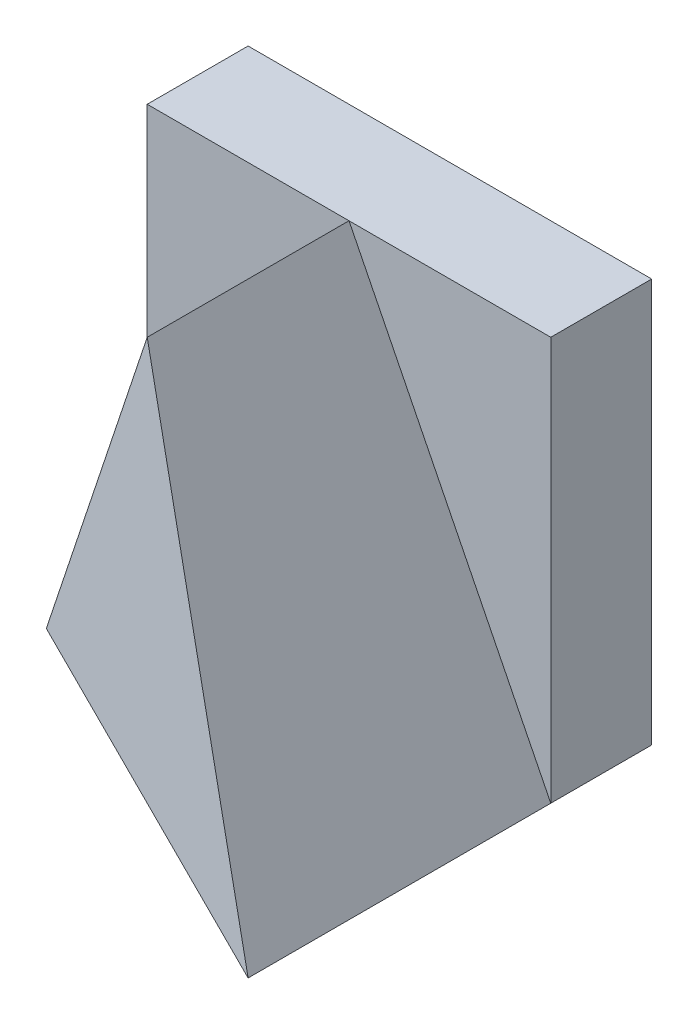
ISO-10303-21;
HEADER;
FILE_DESCRIPTION(('STEP AP214'),'2;1');
FILE_NAME('part.step','',(''),(''),'','','');
FILE_SCHEMA(('AUTOMOTIVE_DESIGN { 1 0 10303 214 1 1 1 1 }'));
ENDSEC;
DATA;
#1=APPLICATION_CONTEXT('core data for automotive mechanical design processes');
#2=APPLICATION_PROTOCOL_DEFINITION('international standard','automotive_design',2000,#1);
#3=PRODUCT_CONTEXT('',#1,'mechanical');
#4=PRODUCT('Part','Part','',(#3));
#5=PRODUCT_RELATED_PRODUCT_CATEGORY('part','',(#4));
#6=PRODUCT_DEFINITION_FORMATION('','',#4);
#7=PRODUCT_DEFINITION_CONTEXT('part definition',#1,'design');
#8=PRODUCT_DEFINITION('design','',#6,#7);
#9=PRODUCT_DEFINITION_SHAPE('','',#8);
#10=(LENGTH_UNIT() NAMED_UNIT(*) SI_UNIT(.MILLI.,.METRE.));
#11=(NAMED_UNIT(*) PLANE_ANGLE_UNIT() SI_UNIT($,.RADIAN.));
#12=(NAMED_UNIT(*) SI_UNIT($,.STERADIAN.) SOLID_ANGLE_UNIT());
#13=UNCERTAINTY_MEASURE_WITH_UNIT(LENGTH_MEASURE(1.E-05),#10,'distance_accuracy_value','');
#14=(GEOMETRIC_REPRESENTATION_CONTEXT(3) GLOBAL_UNCERTAINTY_ASSIGNED_CONTEXT((#13)) GLOBAL_UNIT_ASSIGNED_CONTEXT((#10,
#11,#12)) REPRESENTATION_CONTEXT('',''));
#15=CARTESIAN_POINT('',(0.,0.,0.));
#16=DIRECTION('',(0.,0.,1.));
#17=DIRECTION('',(1.,0.,0.));
#18=AXIS2_PLACEMENT_3D('',#15,#16,#17);
#19=CARTESIAN_POINT('',(0.,4.,0.));
#20=DIRECTION('',(0.,-1.,0.));
#21=DIRECTION('',(0.,0.,-1.));
#22=AXIS2_PLACEMENT_3D('',#19,#20,#21);
#23=PLANE('',#22);
#24=DIRECTION('',(-1.,0.,0.));
#25=VECTOR('',#24,1.);
#26=CARTESIAN_POINT('',(0.,4.,-1.));
#27=LINE('',#26,#25);
#28=CARTESIAN_POINT('',(0.,4.,-1.));
#29=VERTEX_POINT('',#28);
#30=CARTESIAN_POINT('',(-2.,4.,-1.));
#31=VERTEX_POINT('',#30);
#32=EDGE_CURVE('E136',#29,#31,#27,.T.);
#33=ORIENTED_EDGE('',*,*,#32,.F.);
#34=DIRECTION('',(-1.,0.,0.));
#35=VECTOR('',#34,1.);
#36=CARTESIAN_POINT('',(0.,4.,-1.));
#37=LINE('',#36,#35);
#38=CARTESIAN_POINT('',(2.,4.,-1.));
#39=VERTEX_POINT('',#38);
#40=EDGE_CURVE('E123',#39,#29,#37,.T.);
#41=ORIENTED_EDGE('',*,*,#40,.F.);
#42=DIRECTION('',(0.,0.,-1.));
#43=VECTOR('',#42,1.);
#44=CARTESIAN_POINT('',(2.,4.,2.));
#45=LINE('',#44,#43);
#46=CARTESIAN_POINT('',(2.,4.,-2.));
#47=VERTEX_POINT('',#46);
#48=EDGE_CURVE('E111',#39,#47,#45,.T.);
#49=ORIENTED_EDGE('',*,*,#48,.T.);
#50=DIRECTION('',(-1.,0.,0.));
#51=VECTOR('',#50,1.);
#52=CARTESIAN_POINT('',(-2.,4.,-2.));
#53=LINE('',#52,#51);
#54=CARTESIAN_POINT('',(-2.,4.,-2.));
#55=VERTEX_POINT('',#54);
#56=EDGE_CURVE('E74',#47,#55,#53,.T.);
#57=ORIENTED_EDGE('',*,*,#56,.T.);
#58=DIRECTION('',(0.,0.,1.));
#59=VECTOR('',#58,1.);
#60=CARTESIAN_POINT('',(-2.,4.,2.));
#61=LINE('',#60,#59);
#62=EDGE_CURVE('E104',#55,#31,#61,.T.);
#63=ORIENTED_EDGE('',*,*,#62,.T.);
#64=EDGE_LOOP('',(#33,#41,#49,#57,#63));
#65=FACE_BOUND('',#64,.T.);
#66=ADVANCED_FACE('F51',(#65),#23,.F.);
#67=CARTESIAN_POINT('',(-2.,4.,2.));
#68=DIRECTION('',(1.,0.,0.));
#69=DIRECTION('',(0.,0.,-1.));
#70=AXIS2_PLACEMENT_3D('',#67,#68,#69);
#71=PLANE('',#70);
#72=DIRECTION('',(0.,-1.,0.));
#73=VECTOR('',#72,1.);
#74=CARTESIAN_POINT('',(-2.,0.,-1.));
#75=LINE('',#74,#73);
#76=CARTESIAN_POINT('',(-2.,0.,-1.));
#77=VERTEX_POINT('',#76);
#78=EDGE_CURVE('E133',#31,#77,#75,.T.);
#79=ORIENTED_EDGE('',*,*,#78,.F.);
#80=ORIENTED_EDGE('',*,*,#62,.F.);
#81=DIRECTION('',(0.,-1.,0.));
#82=VECTOR('',#81,1.);
#83=CARTESIAN_POINT('',(-2.,4.,-2.));
#84=LINE('',#83,#82);
#85=CARTESIAN_POINT('',(-2.,0.,-2.));
#86=VERTEX_POINT('',#85);
#87=EDGE_CURVE('E90',#55,#86,#84,.T.);
#88=ORIENTED_EDGE('',*,*,#87,.T.);
#89=DIRECTION('',(0.,0.,1.));
#90=VECTOR('',#89,1.);
#91=CARTESIAN_POINT('',(-2.,0.,2.));
#92=LINE('',#91,#90);
#93=EDGE_CURVE('E96',#86,#77,#92,.T.);
#94=ORIENTED_EDGE('',*,*,#93,.T.);
#95=EDGE_LOOP('',(#79,#80,#88,#94));
#96=FACE_BOUND('',#95,.T.);
#97=ADVANCED_FACE('F102',(#96),#71,.F.);
#98=CARTESIAN_POINT('',(2.,4.,2.));
#99=DIRECTION('',(-1.,0.,0.));
#100=DIRECTION('',(0.,0.,1.));
#101=AXIS2_PLACEMENT_3D('',#98,#99,#100);
#102=PLANE('',#101);
#103=DIRECTION('',(0.,1.,0.));
#104=VECTOR('',#103,1.);
#105=CARTESIAN_POINT('',(2.,0.,-1.));
#106=LINE('',#105,#104);
#107=CARTESIAN_POINT('',(2.,0.,-1.));
#108=VERTEX_POINT('',#107);
#109=EDGE_CURVE('E126',#108,#39,#106,.T.);
#110=ORIENTED_EDGE('',*,*,#109,.F.);
#111=DIRECTION('',(0.,0.,-1.));
#112=VECTOR('',#111,1.);
#113=CARTESIAN_POINT('',(2.,0.,2.));
#114=LINE('',#113,#112);
#115=CARTESIAN_POINT('',(2.,0.,-2.));
#116=VERTEX_POINT('',#115);
#117=EDGE_CURVE('E117',#108,#116,#114,.T.);
#118=ORIENTED_EDGE('',*,*,#117,.T.);
#119=DIRECTION('',(0.,-1.,0.));
#120=VECTOR('',#119,1.);
#121=CARTESIAN_POINT('',(2.,4.,-2.));
#122=LINE('',#121,#120);
#123=EDGE_CURVE('E59',#47,#116,#122,.T.);
#124=ORIENTED_EDGE('',*,*,#123,.F.);
#125=ORIENTED_EDGE('',*,*,#48,.F.);
#126=EDGE_LOOP('',(#110,#118,#124,#125));
#127=FACE_BOUND('',#126,.T.);
#128=ADVANCED_FACE('F53',(#127),#102,.F.);
#129=CARTESIAN_POINT('',(-2.,4.,-2.));
#130=DIRECTION('',(0.,0.,1.));
#131=DIRECTION('',(1.,0.,0.));
#132=AXIS2_PLACEMENT_3D('',#129,#130,#131);
#133=PLANE('',#132);
#134=DIRECTION('',(-1.,0.,0.));
#135=VECTOR('',#134,1.);
#136=CARTESIAN_POINT('',(-2.,0.,-2.));
#137=LINE('',#136,#135);
#138=EDGE_CURVE('E87',#116,#86,#137,.T.);
#139=ORIENTED_EDGE('',*,*,#138,.T.);
#140=ORIENTED_EDGE('',*,*,#87,.F.);
#141=ORIENTED_EDGE('',*,*,#56,.F.);
#142=ORIENTED_EDGE('',*,*,#123,.T.);
#143=EDGE_LOOP('',(#139,#140,#141,#142));
#144=FACE_BOUND('',#143,.T.);
#145=ADVANCED_FACE('F89',(#144),#133,.F.);
#146=CARTESIAN_POINT('',(0.,0.,0.));
#147=DIRECTION('',(0.,-1.,0.));
#148=DIRECTION('',(0.,0.,-1.));
#149=AXIS2_PLACEMENT_3D('',#146,#147,#148);
#150=PLANE('',#149);
#151=DIRECTION('',(0.894427190999916,0.,0.447213595499958));
#152=VECTOR('',#151,1.);
#153=CARTESIAN_POINT('',(2.,0.,2.));
#154=LINE('',#153,#152);
#155=CARTESIAN_POINT('',(-2.,0.,0.));
#156=VERTEX_POINT('',#155);
#157=CARTESIAN_POINT('',(2.,0.,2.));
#158=VERTEX_POINT('',#157);
#159=EDGE_CURVE('E143',#156,#158,#154,.T.);
#160=ORIENTED_EDGE('',*,*,#159,.F.);
#161=DIRECTION('',(0.,0.,1.));
#162=VECTOR('',#161,1.);
#163=CARTESIAN_POINT('',(-2.,0.,-1.));
#164=LINE('',#163,#162);
#165=EDGE_CURVE('E110',#77,#156,#164,.T.);
#166=ORIENTED_EDGE('',*,*,#165,.F.);
#167=ORIENTED_EDGE('',*,*,#93,.F.);
#168=ORIENTED_EDGE('',*,*,#138,.F.);
#169=ORIENTED_EDGE('',*,*,#117,.F.);
#170=EDGE_CURVE('E97',#158,#108,#114,.T.);
#171=ORIENTED_EDGE('',*,*,#170,.F.);
#172=EDGE_LOOP('',(#160,#166,#167,#168,#169,#171));
#173=FACE_BOUND('',#172,.T.);
#174=ADVANCED_FACE('F108',(#173),#150,.T.);
#175=CARTESIAN_POINT('',(1.6,0.8,-1.));
#176=DIRECTION('',(0.894427190999916,0.447213595499958,0.));
#177=DIRECTION('',(-0.447213595499958,0.894427190999916,0.));
#178=AXIS2_PLACEMENT_3D('',#175,#176,#177);
#179=PLANE('',#178);
#180=DIRECTION('',(-0.436435780471985,0.87287156094397,-0.218217890235992));
#181=VECTOR('',#180,1.);
#182=CARTESIAN_POINT('',(1.33333333333333,1.33333333333333,1.66666666666667));
#183=LINE('',#182,#181);
#184=CARTESIAN_POINT('',(0.,4.,1.));
#185=VERTEX_POINT('',#184);
#186=EDGE_CURVE('E65',#158,#185,#183,.T.);
#187=ORIENTED_EDGE('',*,*,#186,.F.);
#188=ORIENTED_EDGE('',*,*,#170,.T.);
#189=DIRECTION('',(-0.447213595499958,0.894427190999916,0.));
#190=VECTOR('',#189,1.);
#191=CARTESIAN_POINT('',(1.6,0.8,-1.));
#192=LINE('',#191,#190);
#193=EDGE_CURVE('E129',#108,#29,#192,.T.);
#194=ORIENTED_EDGE('',*,*,#193,.T.);
#195=DIRECTION('',(0.,0.,1.));
#196=VECTOR('',#195,1.);
#197=CARTESIAN_POINT('',(0.,4.,-1.));
#198=LINE('',#197,#196);
#199=EDGE_CURVE('E120',#29,#185,#198,.T.);
#200=ORIENTED_EDGE('',*,*,#199,.T.);
#201=EDGE_LOOP('',(#187,#188,#194,#200));
#202=FACE_BOUND('',#201,.T.);
#203=ADVANCED_FACE('F151',(#202),#179,.T.);
#204=CARTESIAN_POINT('',(0.,0.,-1.));
#205=DIRECTION('',(0.,0.,1.));
#206=DIRECTION('',(1.,0.,0.));
#207=AXIS2_PLACEMENT_3D('',#204,#205,#206);
#208=PLANE('',#207);
#209=ORIENTED_EDGE('',*,*,#193,.F.);
#210=ORIENTED_EDGE('',*,*,#109,.T.);
#211=ORIENTED_EDGE('',*,*,#40,.T.);
#212=EDGE_LOOP('',(#209,#210,#211));
#213=FACE_BOUND('',#212,.T.);
#214=ADVANCED_FACE('F161',(#213),#208,.T.);
#215=CARTESIAN_POINT('',(-1.6,0.8,-1.));
#216=DIRECTION('',(-0.894427190999916,0.447213595499958,0.));
#217=DIRECTION('',(-0.447213595499958,-0.894427190999916,0.));
#218=AXIS2_PLACEMENT_3D('',#215,#216,#217);
#219=PLANE('',#218);
#220=DIRECTION('',(-0.436435780471985,-0.87287156094397,-0.218217890235992));
#221=VECTOR('',#220,1.);
#222=CARTESIAN_POINT('',(-1.71428571428571,0.571428571428571,0.142857142857143));
#223=LINE('',#222,#221);
#224=EDGE_CURVE('E12',#185,#156,#223,.T.);
#225=ORIENTED_EDGE('',*,*,#224,.F.);
#226=ORIENTED_EDGE('',*,*,#199,.F.);
#227=DIRECTION('',(-0.447213595499958,-0.894427190999916,0.));
#228=VECTOR('',#227,1.);
#229=CARTESIAN_POINT('',(-1.6,0.8,-1.));
#230=LINE('',#229,#228);
#231=EDGE_CURVE('E139',#29,#77,#230,.T.);
#232=ORIENTED_EDGE('',*,*,#231,.T.);
#233=ORIENTED_EDGE('',*,*,#165,.T.);
#234=EDGE_LOOP('',(#225,#226,#232,#233));
#235=FACE_BOUND('',#234,.T.);
#236=ADVANCED_FACE('F172',(#235),#219,.T.);
#237=CARTESIAN_POINT('',(0.,0.,-1.));
#238=DIRECTION('',(0.,0.,1.));
#239=DIRECTION('',(1.,0.,0.));
#240=AXIS2_PLACEMENT_3D('',#237,#238,#239);
#241=PLANE('',#240);
#242=ORIENTED_EDGE('',*,*,#231,.F.);
#243=ORIENTED_EDGE('',*,*,#32,.T.);
#244=ORIENTED_EDGE('',*,*,#78,.T.);
#245=EDGE_LOOP('',(#242,#243,#244));
#246=FACE_BOUND('',#245,.T.);
#247=ADVANCED_FACE('F167',(#246),#241,.T.);
#248=CARTESIAN_POINT('',(2.,7.,2.));
#249=DIRECTION('',(0.447213595499958,0.,-0.894427190999916));
#250=DIRECTION('',(-0.894427190999916,0.,-0.447213595499958));
#251=AXIS2_PLACEMENT_3D('',#248,#249,#250);
#252=PLANE('',#251);
#253=ORIENTED_EDGE('',*,*,#186,.T.);
#254=ORIENTED_EDGE('',*,*,#224,.T.);
#255=ORIENTED_EDGE('',*,*,#159,.T.);
#256=EDGE_LOOP('',(#253,#254,#255));
#257=FACE_BOUND('',#256,.T.);
#258=ADVANCED_FACE('F145',(#257),#252,.F.);
#259=CLOSED_SHELL('',(#66,#97,#128,#145,#174,#203,#214,#236,#247,#258));
#260=MANIFOLD_SOLID_BREP('B2',#259);
#261=ADVANCED_BREP_SHAPE_REPRESENTATION('',(#18,#260),#14);
#262=SHAPE_DEFINITION_REPRESENTATION(#9,#261);
ENDSEC;
END-ISO-10303-21;
